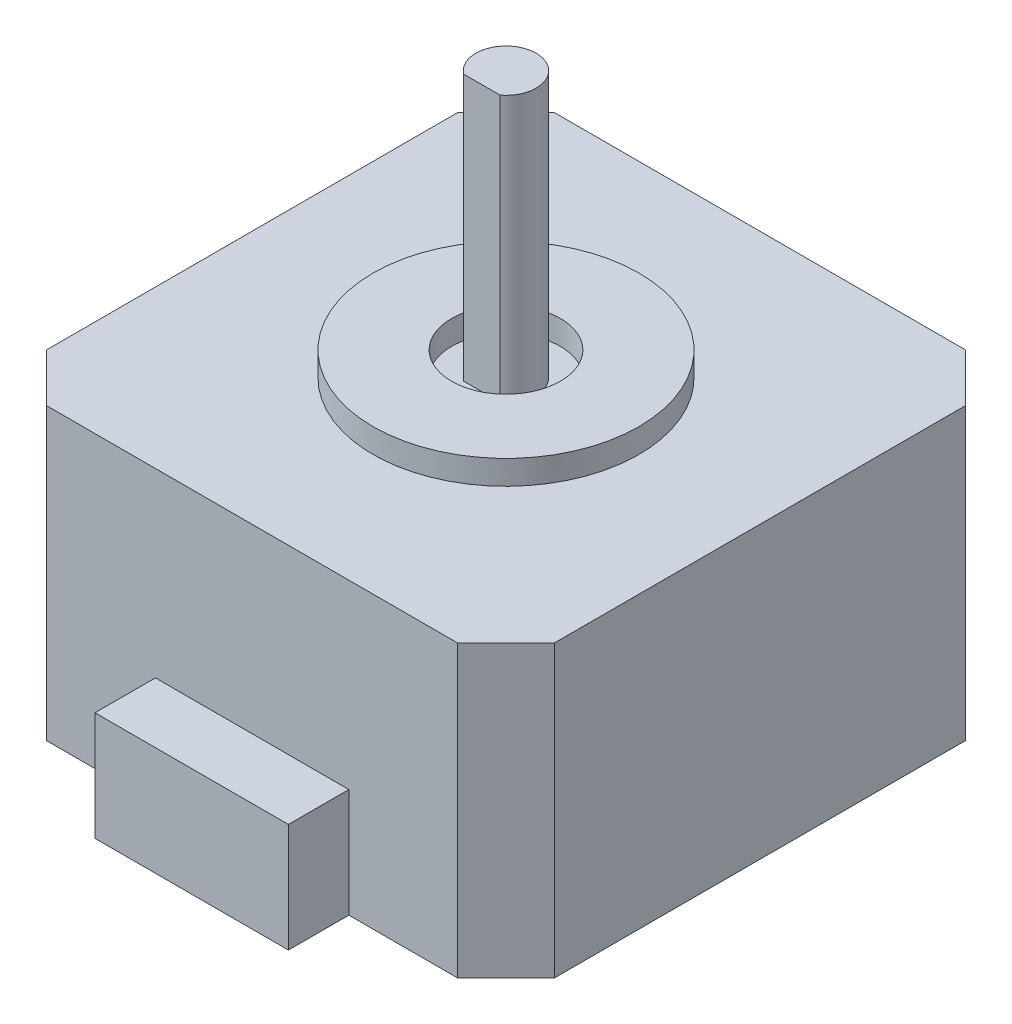
ISO-10303-21;
HEADER;
FILE_DESCRIPTION(('STEP AP214'),'2;1');
FILE_NAME('part.step','',(''),(''),'','','');
FILE_SCHEMA(('AUTOMOTIVE_DESIGN { 1 0 10303 214 1 1 1 1 }'));
ENDSEC;
DATA;
#1=APPLICATION_CONTEXT('core data for automotive mechanical design processes');
#2=APPLICATION_PROTOCOL_DEFINITION('international standard','automotive_design',2000,#1);
#3=PRODUCT_CONTEXT('',#1,'mechanical');
#4=PRODUCT('Part','Part','',(#3));
#5=PRODUCT_RELATED_PRODUCT_CATEGORY('part','',(#4));
#6=PRODUCT_DEFINITION_FORMATION('','',#4);
#7=PRODUCT_DEFINITION_CONTEXT('part definition',#1,'design');
#8=PRODUCT_DEFINITION('design','',#6,#7);
#9=PRODUCT_DEFINITION_SHAPE('','',#8);
#10=(LENGTH_UNIT() NAMED_UNIT(*) SI_UNIT(.MILLI.,.METRE.));
#11=(NAMED_UNIT(*) PLANE_ANGLE_UNIT() SI_UNIT($,.RADIAN.));
#12=(NAMED_UNIT(*) SI_UNIT($,.STERADIAN.) SOLID_ANGLE_UNIT());
#13=UNCERTAINTY_MEASURE_WITH_UNIT(LENGTH_MEASURE(1.E-05),#10,'distance_accuracy_value','');
#14=(GEOMETRIC_REPRESENTATION_CONTEXT(3) GLOBAL_UNCERTAINTY_ASSIGNED_CONTEXT((#13)) GLOBAL_UNIT_ASSIGNED_CONTEXT((#10,
#11,#12)) REPRESENTATION_CONTEXT('',''));
#15=CARTESIAN_POINT('',(0.,0.,0.));
#16=DIRECTION('',(0.,0.,1.));
#17=DIRECTION('',(1.,0.,0.));
#18=AXIS2_PLACEMENT_3D('',#15,#16,#17);
#19=CARTESIAN_POINT('',(0.,24.,0.));
#20=DIRECTION('',(0.,-1.,0.));
#21=DIRECTION('',(0.,0.,-1.));
#22=AXIS2_PLACEMENT_3D('',#19,#20,#21);
#23=PLANE('',#22);
#24=CARTESIAN_POINT('',(21.,24.,-21.));
#25=DIRECTION('',(0.,1.,0.));
#26=DIRECTION('',(0.,0.,1.));
#27=AXIS2_PLACEMENT_3D('',#24,#25,#26);
#28=CIRCLE('',#27,4.5);
#29=CARTESIAN_POINT('',(21.,24.,-16.5));
#30=VERTEX_POINT('',#29);
#31=EDGE_CURVE('E156',#30,#30,#28,.T.);
#32=ORIENTED_EDGE('',*,*,#31,.T.);
#33=EDGE_LOOP('',(#32));
#34=FACE_BOUND('',#33,.T.);
#35=CARTESIAN_POINT('',(21.,24.,-21.));
#36=DIRECTION('',(0.,1.,0.));
#37=DIRECTION('',(0.,0.,1.));
#38=AXIS2_PLACEMENT_3D('',#35,#36,#37);
#39=CIRCLE('',#38,2.5);
#40=CARTESIAN_POINT('',(22.5,24.,-19.));
#41=VERTEX_POINT('',#40);
#42=CARTESIAN_POINT('',(19.5,24.,-19.));
#43=VERTEX_POINT('',#42);
#44=EDGE_CURVE('E155',#41,#43,#39,.T.);
#45=ORIENTED_EDGE('',*,*,#44,.F.);
#46=DIRECTION('',(1.,0.,0.));
#47=VECTOR('',#46,1.);
#48=CARTESIAN_POINT('',(19.5,24.,-19.));
#49=LINE('',#48,#47);
#50=EDGE_CURVE('E152',#43,#41,#49,.T.);
#51=ORIENTED_EDGE('',*,*,#50,.F.);
#52=EDGE_LOOP('',(#45,#51));
#53=FACE_BOUND('',#52,.T.);
#54=ADVANCED_FACE('F35',(#34,#53),#23,.F.);
#55=CARTESIAN_POINT('',(0.,24.,0.));
#56=DIRECTION('',(0.,0.,-1.));
#57=DIRECTION('',(-1.,0.,0.));
#58=AXIS2_PLACEMENT_3D('',#55,#56,#57);
#59=PLANE('',#58);
#60=DIRECTION('',(1.,0.,0.));
#61=VECTOR('',#60,1.);
#62=CARTESIAN_POINT('',(0.,0.,0.));
#63=LINE('',#62,#61);
#64=CARTESIAN_POINT('',(29.,0.,0.));
#65=VERTEX_POINT('',#64);
#66=CARTESIAN_POINT('',(38.,0.,0.));
#67=VERTEX_POINT('',#66);
#68=EDGE_CURVE('E213',#65,#67,#63,.T.);
#69=ORIENTED_EDGE('',*,*,#68,.T.);
#70=DIRECTION('',(0.,1.,0.));
#71=VECTOR('',#70,1.);
#72=CARTESIAN_POINT('',(38.,24.,0.));
#73=LINE('',#72,#71);
#74=CARTESIAN_POINT('',(38.,24.,0.));
#75=VERTEX_POINT('',#74);
#76=EDGE_CURVE('E238',#67,#75,#73,.T.);
#77=ORIENTED_EDGE('',*,*,#76,.T.);
#78=DIRECTION('',(1.,0.,0.));
#79=VECTOR('',#78,1.);
#80=CARTESIAN_POINT('',(0.,24.,0.));
#81=LINE('',#80,#79);
#82=CARTESIAN_POINT('',(4.00000000000001,24.,0.));
#83=VERTEX_POINT('',#82);
#84=EDGE_CURVE('E202',#83,#75,#81,.T.);
#85=ORIENTED_EDGE('',*,*,#84,.F.);
#86=DIRECTION('',(0.,-1.,0.));
#87=VECTOR('',#86,1.);
#88=CARTESIAN_POINT('',(4.00000000000001,24.,0.));
#89=LINE('',#88,#87);
#90=CARTESIAN_POINT('',(4.00000000000001,0.,0.));
#91=VERTEX_POINT('',#90);
#92=EDGE_CURVE('E222',#83,#91,#89,.T.);
#93=ORIENTED_EDGE('',*,*,#92,.T.);
#94=CARTESIAN_POINT('',(13.,0.,0.));
#95=VERTEX_POINT('',#94);
#96=EDGE_CURVE('E214',#91,#95,#63,.T.);
#97=ORIENTED_EDGE('',*,*,#96,.T.);
#98=DIRECTION('',(0.,-1.,0.));
#99=VECTOR('',#98,1.);
#100=CARTESIAN_POINT('',(13.,0.,0.));
#101=LINE('',#100,#99);
#102=CARTESIAN_POINT('',(13.,9.,0.));
#103=VERTEX_POINT('',#102);
#104=EDGE_CURVE('E169',#103,#95,#101,.T.);
#105=ORIENTED_EDGE('',*,*,#104,.F.);
#106=DIRECTION('',(-1.,0.,0.));
#107=VECTOR('',#106,1.);
#108=CARTESIAN_POINT('',(13.,9.,0.));
#109=LINE('',#108,#107);
#110=CARTESIAN_POINT('',(29.,9.,0.));
#111=VERTEX_POINT('',#110);
#112=EDGE_CURVE('E174',#111,#103,#109,.T.);
#113=ORIENTED_EDGE('',*,*,#112,.F.);
#114=DIRECTION('',(0.,1.,0.));
#115=VECTOR('',#114,1.);
#116=CARTESIAN_POINT('',(29.,0.,0.));
#117=LINE('',#116,#115);
#118=EDGE_CURVE('E183',#65,#111,#117,.T.);
#119=ORIENTED_EDGE('',*,*,#118,.F.);
#120=EDGE_LOOP('',(#69,#77,#85,#93,#97,#105,#113,#119));
#121=FACE_BOUND('',#120,.T.);
#122=ADVANCED_FACE('F273',(#121),#59,.F.);
#123=CARTESIAN_POINT('',(0.,24.,0.));
#124=DIRECTION('',(1.,0.,0.));
#125=DIRECTION('',(0.,0.,-1.));
#126=AXIS2_PLACEMENT_3D('',#123,#124,#125);
#127=PLANE('',#126);
#128=DIRECTION('',(0.,0.,1.));
#129=VECTOR('',#128,1.);
#130=CARTESIAN_POINT('',(0.,24.,0.));
#131=LINE('',#130,#129);
#132=CARTESIAN_POINT('',(0.,24.,-38.));
#133=VERTEX_POINT('',#132);
#134=CARTESIAN_POINT('',(0.,24.,-4.00000000000001));
#135=VERTEX_POINT('',#134);
#136=EDGE_CURVE('E200',#133,#135,#131,.T.);
#137=ORIENTED_EDGE('',*,*,#136,.F.);
#138=DIRECTION('',(0.,-1.,0.));
#139=VECTOR('',#138,1.);
#140=CARTESIAN_POINT('',(0.,24.,-38.));
#141=LINE('',#140,#139);
#142=CARTESIAN_POINT('',(0.,0.,-38.));
#143=VERTEX_POINT('',#142);
#144=EDGE_CURVE('E251',#133,#143,#141,.T.);
#145=ORIENTED_EDGE('',*,*,#144,.T.);
#146=DIRECTION('',(0.,0.,1.));
#147=VECTOR('',#146,1.);
#148=CARTESIAN_POINT('',(0.,0.,0.));
#149=LINE('',#148,#147);
#150=CARTESIAN_POINT('',(0.,0.,-4.00000000000001));
#151=VERTEX_POINT('',#150);
#152=EDGE_CURVE('E199',#143,#151,#149,.T.);
#153=ORIENTED_EDGE('',*,*,#152,.T.);
#154=DIRECTION('',(0.,1.,0.));
#155=VECTOR('',#154,1.);
#156=CARTESIAN_POINT('',(0.,24.,-4.00000000000001));
#157=LINE('',#156,#155);
#158=EDGE_CURVE('E228',#151,#135,#157,.T.);
#159=ORIENTED_EDGE('',*,*,#158,.T.);
#160=EDGE_LOOP('',(#137,#145,#153,#159));
#161=FACE_BOUND('',#160,.T.);
#162=ADVANCED_FACE('F257',(#161),#127,.F.);
#163=CARTESIAN_POINT('',(42.,24.,0.));
#164=DIRECTION('',(-1.,0.,0.));
#165=DIRECTION('',(0.,0.,1.));
#166=AXIS2_PLACEMENT_3D('',#163,#164,#165);
#167=PLANE('',#166);
#168=DIRECTION('',(0.,0.,-1.));
#169=VECTOR('',#168,1.);
#170=CARTESIAN_POINT('',(42.,0.,0.));
#171=LINE('',#170,#169);
#172=CARTESIAN_POINT('',(42.,0.,-4.00000000000002));
#173=VERTEX_POINT('',#172);
#174=CARTESIAN_POINT('',(42.,0.,-38.));
#175=VERTEX_POINT('',#174);
#176=EDGE_CURVE('E216',#173,#175,#171,.T.);
#177=ORIENTED_EDGE('',*,*,#176,.T.);
#178=DIRECTION('',(0.,1.,0.));
#179=VECTOR('',#178,1.);
#180=CARTESIAN_POINT('',(42.,24.,-38.));
#181=LINE('',#180,#179);
#182=CARTESIAN_POINT('',(42.,24.,-38.));
#183=VERTEX_POINT('',#182);
#184=EDGE_CURVE('E247',#175,#183,#181,.T.);
#185=ORIENTED_EDGE('',*,*,#184,.T.);
#186=DIRECTION('',(0.,0.,-1.));
#187=VECTOR('',#186,1.);
#188=CARTESIAN_POINT('',(42.,24.,0.));
#189=LINE('',#188,#187);
#190=CARTESIAN_POINT('',(42.,24.,-4.00000000000002));
#191=VERTEX_POINT('',#190);
#192=EDGE_CURVE('E206',#191,#183,#189,.T.);
#193=ORIENTED_EDGE('',*,*,#192,.F.);
#194=DIRECTION('',(0.,-1.,0.));
#195=VECTOR('',#194,1.);
#196=CARTESIAN_POINT('',(42.,24.,-4.00000000000002));
#197=LINE('',#196,#195);
#198=EDGE_CURVE('E233',#191,#173,#197,.T.);
#199=ORIENTED_EDGE('',*,*,#198,.T.);
#200=EDGE_LOOP('',(#177,#185,#193,#199));
#201=FACE_BOUND('',#200,.T.);
#202=ADVANCED_FACE('F282',(#201),#167,.F.);
#203=CARTESIAN_POINT('',(0.,24.,-42.));
#204=DIRECTION('',(0.,0.,1.));
#205=DIRECTION('',(1.,0.,0.));
#206=AXIS2_PLACEMENT_3D('',#203,#204,#205);
#207=PLANE('',#206);
#208=DIRECTION('',(-1.,0.,0.));
#209=VECTOR('',#208,1.);
#210=CARTESIAN_POINT('',(0.,0.,-42.));
#211=LINE('',#210,#209);
#212=CARTESIAN_POINT('',(38.,0.,-42.));
#213=VERTEX_POINT('',#212);
#214=CARTESIAN_POINT('',(4.00000000000001,0.,-42.));
#215=VERTEX_POINT('',#214);
#216=EDGE_CURVE('E203',#213,#215,#211,.T.);
#217=ORIENTED_EDGE('',*,*,#216,.T.);
#218=DIRECTION('',(0.,1.,0.));
#219=VECTOR('',#218,1.);
#220=CARTESIAN_POINT('',(4.00000000000001,24.,-42.));
#221=LINE('',#220,#219);
#222=CARTESIAN_POINT('',(4.00000000000001,24.,-42.));
#223=VERTEX_POINT('',#222);
#224=EDGE_CURVE('E44',#215,#223,#221,.T.);
#225=ORIENTED_EDGE('',*,*,#224,.T.);
#226=DIRECTION('',(-1.,0.,0.));
#227=VECTOR('',#226,1.);
#228=CARTESIAN_POINT('',(0.,24.,-42.));
#229=LINE('',#228,#227);
#230=CARTESIAN_POINT('',(38.,24.,-42.));
#231=VERTEX_POINT('',#230);
#232=EDGE_CURVE('E209',#231,#223,#229,.T.);
#233=ORIENTED_EDGE('',*,*,#232,.F.);
#234=DIRECTION('',(0.,-1.,0.));
#235=VECTOR('',#234,1.);
#236=CARTESIAN_POINT('',(38.,24.,-42.));
#237=LINE('',#236,#235);
#238=EDGE_CURVE('E242',#231,#213,#237,.T.);
#239=ORIENTED_EDGE('',*,*,#238,.T.);
#240=EDGE_LOOP('',(#217,#225,#233,#239));
#241=FACE_BOUND('',#240,.T.);
#242=ADVANCED_FACE('F288',(#241),#207,.F.);
#243=CARTESIAN_POINT('',(21.,24.,-21.));
#244=DIRECTION('',(0.,-1.,0.));
#245=DIRECTION('',(0.,0.,-1.));
#246=AXIS2_PLACEMENT_3D('',#243,#244,#245);
#247=CIRCLE('',#246,11.);
#248=CARTESIAN_POINT('',(21.,24.,-32.));
#249=VERTEX_POINT('',#248);
#250=EDGE_CURVE('E211',#249,#249,#247,.F.);
#251=ORIENTED_EDGE('',*,*,#250,.F.);
#252=EDGE_LOOP('',(#251));
#253=FACE_BOUND('',#252,.T.);
#254=ORIENTED_EDGE('',*,*,#232,.T.);
#255=DIRECTION('',(0.707106781186548,0.,-0.707106781186547));
#256=VECTOR('',#255,1.);
#257=CARTESIAN_POINT('',(0.,24.,-38.));
#258=LINE('',#257,#256);
#259=EDGE_CURVE('E11',#223,#133,#258,.F.);
#260=ORIENTED_EDGE('',*,*,#259,.T.);
#261=ORIENTED_EDGE('',*,*,#136,.T.);
#262=DIRECTION('',(-0.707106781186548,0.,-0.707106781186548));
#263=VECTOR('',#262,1.);
#264=CARTESIAN_POINT('',(4.00000000000001,24.,0.));
#265=LINE('',#264,#263);
#266=EDGE_CURVE('E231',#135,#83,#265,.F.);
#267=ORIENTED_EDGE('',*,*,#266,.T.);
#268=ORIENTED_EDGE('',*,*,#84,.T.);
#269=DIRECTION('',(-0.707106781186548,0.,0.707106781186548));
#270=VECTOR('',#269,1.);
#271=CARTESIAN_POINT('',(42.,24.,-4.00000000000002));
#272=LINE('',#271,#270);
#273=EDGE_CURVE('E240',#75,#191,#272,.F.);
#274=ORIENTED_EDGE('',*,*,#273,.T.);
#275=ORIENTED_EDGE('',*,*,#192,.T.);
#276=DIRECTION('',(0.707106781186548,0.,0.707106781186548));
#277=VECTOR('',#276,1.);
#278=CARTESIAN_POINT('',(38.,24.,-42.));
#279=LINE('',#278,#277);
#280=EDGE_CURVE('E249',#183,#231,#279,.F.);
#281=ORIENTED_EDGE('',*,*,#280,.T.);
#282=EDGE_LOOP('',(#254,#260,#261,#267,#268,#274,#275,#281));
#283=FACE_BOUND('',#282,.T.);
#284=ADVANCED_FACE('F269',(#253,#283),#23,.F.);
#285=CARTESIAN_POINT('',(0.,0.,0.));
#286=DIRECTION('',(0.,-1.,0.));
#287=DIRECTION('',(0.,0.,-1.));
#288=AXIS2_PLACEMENT_3D('',#285,#286,#287);
#289=PLANE('',#288);
#290=ORIENTED_EDGE('',*,*,#152,.F.);
#291=DIRECTION('',(-0.707106781186548,0.,0.707106781186547));
#292=VECTOR('',#291,1.);
#293=CARTESIAN_POINT('',(-19.,0.,-19.));
#294=LINE('',#293,#292);
#295=EDGE_CURVE('E58',#143,#215,#294,.F.);
#296=ORIENTED_EDGE('',*,*,#295,.T.);
#297=ORIENTED_EDGE('',*,*,#216,.F.);
#298=DIRECTION('',(-0.707106781186548,0.,-0.707106781186548));
#299=VECTOR('',#298,1.);
#300=CARTESIAN_POINT('',(40.,0.,-40.));
#301=LINE('',#300,#299);
#302=EDGE_CURVE('E245',#213,#175,#301,.F.);
#303=ORIENTED_EDGE('',*,*,#302,.T.);
#304=ORIENTED_EDGE('',*,*,#176,.F.);
#305=DIRECTION('',(0.707106781186548,0.,-0.707106781186548));
#306=VECTOR('',#305,1.);
#307=CARTESIAN_POINT('',(19.,0.,19.));
#308=LINE('',#307,#306);
#309=EDGE_CURVE('E236',#173,#67,#308,.F.);
#310=ORIENTED_EDGE('',*,*,#309,.T.);
#311=ORIENTED_EDGE('',*,*,#68,.F.);
#312=DIRECTION('',(0.,0.,-1.));
#313=VECTOR('',#312,1.);
#314=CARTESIAN_POINT('',(29.,0.,5.));
#315=LINE('',#314,#313);
#316=CARTESIAN_POINT('',(29.,0.,5.));
#317=VERTEX_POINT('',#316);
#318=EDGE_CURVE('E193',#317,#65,#315,.T.);
#319=ORIENTED_EDGE('',*,*,#318,.F.);
#320=DIRECTION('',(1.,0.,0.));
#321=VECTOR('',#320,1.);
#322=CARTESIAN_POINT('',(13.,0.,5.));
#323=LINE('',#322,#321);
#324=CARTESIAN_POINT('',(13.,0.,5.));
#325=VERTEX_POINT('',#324);
#326=EDGE_CURVE('E173',#325,#317,#323,.T.);
#327=ORIENTED_EDGE('',*,*,#326,.F.);
#328=DIRECTION('',(0.,0.,-1.));
#329=VECTOR('',#328,1.);
#330=CARTESIAN_POINT('',(13.,0.,5.));
#331=LINE('',#330,#329);
#332=EDGE_CURVE('E196',#325,#95,#331,.T.);
#333=ORIENTED_EDGE('',*,*,#332,.T.);
#334=ORIENTED_EDGE('',*,*,#96,.F.);
#335=DIRECTION('',(0.707106781186548,0.,0.707106781186548));
#336=VECTOR('',#335,1.);
#337=CARTESIAN_POINT('',(2.00000000000001,0.,-2.00000000000001));
#338=LINE('',#337,#336);
#339=EDGE_CURVE('E225',#91,#151,#338,.F.);
#340=ORIENTED_EDGE('',*,*,#339,.T.);
#341=EDGE_LOOP('',(#290,#296,#297,#303,#304,#310,#311,#319,#327,#333,#334,#340));
#342=FACE_BOUND('',#341,.T.);
#343=ADVANCED_FACE('F260',(#342),#289,.T.);
#344=CARTESIAN_POINT('',(13.,0.,5.));
#345=DIRECTION('',(1.,0.,0.));
#346=DIRECTION('',(0.,0.,-1.));
#347=AXIS2_PLACEMENT_3D('',#344,#345,#346);
#348=PLANE('',#347);
#349=ORIENTED_EDGE('',*,*,#104,.T.);
#350=ORIENTED_EDGE('',*,*,#332,.F.);
#351=DIRECTION('',(0.,-1.,0.));
#352=VECTOR('',#351,1.);
#353=CARTESIAN_POINT('',(13.,0.,5.));
#354=LINE('',#353,#352);
#355=CARTESIAN_POINT('',(13.,9.,5.));
#356=VERTEX_POINT('',#355);
#357=EDGE_CURVE('E170',#356,#325,#354,.T.);
#358=ORIENTED_EDGE('',*,*,#357,.F.);
#359=DIRECTION('',(0.,0.,-1.));
#360=VECTOR('',#359,1.);
#361=CARTESIAN_POINT('',(13.,9.,5.));
#362=LINE('',#361,#360);
#363=EDGE_CURVE('E180',#356,#103,#362,.T.);
#364=ORIENTED_EDGE('',*,*,#363,.T.);
#365=EDGE_LOOP('',(#349,#350,#358,#364));
#366=FACE_BOUND('',#365,.T.);
#367=ADVANCED_FACE('F301',(#366),#348,.F.);
#368=CARTESIAN_POINT('',(29.,0.,5.));
#369=DIRECTION('',(-1.,0.,0.));
#370=DIRECTION('',(0.,0.,1.));
#371=AXIS2_PLACEMENT_3D('',#368,#369,#370);
#372=PLANE('',#371);
#373=ORIENTED_EDGE('',*,*,#118,.T.);
#374=DIRECTION('',(0.,0.,-1.));
#375=VECTOR('',#374,1.);
#376=CARTESIAN_POINT('',(29.,9.,5.));
#377=LINE('',#376,#375);
#378=CARTESIAN_POINT('',(29.,9.,5.));
#379=VERTEX_POINT('',#378);
#380=EDGE_CURVE('E190',#379,#111,#377,.T.);
#381=ORIENTED_EDGE('',*,*,#380,.F.);
#382=DIRECTION('',(0.,1.,0.));
#383=VECTOR('',#382,1.);
#384=CARTESIAN_POINT('',(29.,0.,5.));
#385=LINE('',#384,#383);
#386=EDGE_CURVE('E176',#317,#379,#385,.T.);
#387=ORIENTED_EDGE('',*,*,#386,.F.);
#388=ORIENTED_EDGE('',*,*,#318,.T.);
#389=EDGE_LOOP('',(#373,#381,#387,#388));
#390=FACE_BOUND('',#389,.T.);
#391=ADVANCED_FACE('F292',(#390),#372,.F.);
#392=CARTESIAN_POINT('',(13.,9.,5.));
#393=DIRECTION('',(0.,-1.,0.));
#394=DIRECTION('',(0.,0.,-1.));
#395=AXIS2_PLACEMENT_3D('',#392,#393,#394);
#396=PLANE('',#395);
#397=ORIENTED_EDGE('',*,*,#112,.T.);
#398=ORIENTED_EDGE('',*,*,#363,.F.);
#399=DIRECTION('',(-1.,0.,0.));
#400=VECTOR('',#399,1.);
#401=CARTESIAN_POINT('',(13.,9.,5.));
#402=LINE('',#401,#400);
#403=EDGE_CURVE('E178',#379,#356,#402,.T.);
#404=ORIENTED_EDGE('',*,*,#403,.F.);
#405=ORIENTED_EDGE('',*,*,#380,.T.);
#406=EDGE_LOOP('',(#397,#398,#404,#405));
#407=FACE_BOUND('',#406,.T.);
#408=ADVANCED_FACE('F303',(#407),#396,.F.);
#409=CARTESIAN_POINT('',(0.,0.,5.));
#410=DIRECTION('',(0.,0.,-1.));
#411=DIRECTION('',(-1.,0.,0.));
#412=AXIS2_PLACEMENT_3D('',#409,#410,#411);
#413=PLANE('',#412);
#414=ORIENTED_EDGE('',*,*,#357,.T.);
#415=ORIENTED_EDGE('',*,*,#326,.T.);
#416=ORIENTED_EDGE('',*,*,#386,.T.);
#417=ORIENTED_EDGE('',*,*,#403,.T.);
#418=EDGE_LOOP('',(#414,#415,#416,#417));
#419=FACE_BOUND('',#418,.T.);
#420=ADVANCED_FACE('F296',(#419),#413,.F.);
#421=CARTESIAN_POINT('',(21.,26.,-21.));
#422=DIRECTION('',(0.,1.,0.));
#423=DIRECTION('',(0.,0.,1.));
#424=AXIS2_PLACEMENT_3D('',#421,#422,#423);
#425=PLANE('',#424);
#426=CARTESIAN_POINT('',(21.,26.,-21.));
#427=DIRECTION('',(0.,1.,0.));
#428=DIRECTION('',(0.,0.,1.));
#429=AXIS2_PLACEMENT_3D('',#426,#427,#428);
#430=CIRCLE('',#429,11.);
#431=CARTESIAN_POINT('',(21.,26.,-10.));
#432=VERTEX_POINT('',#431);
#433=EDGE_CURVE('E165',#432,#432,#430,.T.);
#434=ORIENTED_EDGE('',*,*,#433,.T.);
#435=EDGE_LOOP('',(#434));
#436=FACE_BOUND('',#435,.T.);
#437=CARTESIAN_POINT('',(21.,26.,-21.));
#438=DIRECTION('',(0.,1.,0.));
#439=DIRECTION('',(0.,0.,1.));
#440=AXIS2_PLACEMENT_3D('',#437,#438,#439);
#441=CIRCLE('',#440,4.5);
#442=CARTESIAN_POINT('',(21.,26.,-16.5));
#443=VERTEX_POINT('',#442);
#444=EDGE_CURVE('E159',#443,#443,#441,.T.);
#445=ORIENTED_EDGE('',*,*,#444,.F.);
#446=EDGE_LOOP('',(#445));
#447=FACE_BOUND('',#446,.T.);
#448=ADVANCED_FACE('F310',(#436,#447),#425,.T.);
#449=CARTESIAN_POINT('',(21.,26.,-21.));
#450=DIRECTION('',(0.,-1.,0.));
#451=DIRECTION('',(0.,0.,-1.));
#452=AXIS2_PLACEMENT_3D('',#449,#450,#451);
#453=CYLINDRICAL_SURFACE('',#452,11.);
#454=ORIENTED_EDGE('',*,*,#433,.F.);
#455=EDGE_LOOP('',(#454));
#456=FACE_BOUND('',#455,.T.);
#457=ORIENTED_EDGE('',*,*,#250,.T.);
#458=EDGE_LOOP('',(#457));
#459=FACE_BOUND('',#458,.T.);
#460=ADVANCED_FACE('F332',(#456,#459),#453,.T.);
#461=CARTESIAN_POINT('',(21.,26.,-21.));
#462=DIRECTION('',(0.,-1.,0.));
#463=DIRECTION('',(0.,0.,-1.));
#464=AXIS2_PLACEMENT_3D('',#461,#462,#463);
#465=CYLINDRICAL_SURFACE('',#464,4.5);
#466=ORIENTED_EDGE('',*,*,#444,.T.);
#467=EDGE_LOOP('',(#466));
#468=FACE_BOUND('',#467,.T.);
#469=ORIENTED_EDGE('',*,*,#31,.F.);
#470=EDGE_LOOP('',(#469));
#471=FACE_BOUND('',#470,.T.);
#472=ADVANCED_FACE('F334',(#468,#471),#465,.F.);
#473=CARTESIAN_POINT('',(21.,46.,-21.));
#474=DIRECTION('',(0.,-1.,0.));
#475=DIRECTION('',(0.,0.,-1.));
#476=AXIS2_PLACEMENT_3D('',#473,#474,#475);
#477=CYLINDRICAL_SURFACE('',#476,2.5);
#478=ORIENTED_EDGE('',*,*,#44,.T.);
#479=DIRECTION('',(0.,-1.,0.));
#480=VECTOR('',#479,1.);
#481=CARTESIAN_POINT('',(19.5,46.,-19.));
#482=LINE('',#481,#480);
#483=CARTESIAN_POINT('',(19.5,46.,-19.));
#484=VERTEX_POINT('',#483);
#485=EDGE_CURVE('E142',#484,#43,#482,.T.);
#486=ORIENTED_EDGE('',*,*,#485,.F.);
#487=CARTESIAN_POINT('',(21.,46.,-21.));
#488=DIRECTION('',(0.,1.,0.));
#489=DIRECTION('',(0.,0.,1.));
#490=AXIS2_PLACEMENT_3D('',#487,#488,#489);
#491=CIRCLE('',#490,2.5);
#492=CARTESIAN_POINT('',(22.5,46.,-19.));
#493=VERTEX_POINT('',#492);
#494=EDGE_CURVE('E148',#493,#484,#491,.T.);
#495=ORIENTED_EDGE('',*,*,#494,.F.);
#496=DIRECTION('',(0.,-1.,0.));
#497=VECTOR('',#496,1.);
#498=CARTESIAN_POINT('',(22.5,46.,-19.));
#499=LINE('',#498,#497);
#500=EDGE_CURVE('E145',#493,#41,#499,.T.);
#501=ORIENTED_EDGE('',*,*,#500,.T.);
#502=EDGE_LOOP('',(#478,#486,#495,#501));
#503=FACE_BOUND('',#502,.T.);
#504=ADVANCED_FACE('F154',(#503),#477,.T.);
#505=CARTESIAN_POINT('',(19.5,46.,-19.));
#506=DIRECTION('',(0.,0.,-1.));
#507=DIRECTION('',(-1.,0.,0.));
#508=AXIS2_PLACEMENT_3D('',#505,#506,#507);
#509=PLANE('',#508);
#510=ORIENTED_EDGE('',*,*,#50,.T.);
#511=ORIENTED_EDGE('',*,*,#500,.F.);
#512=DIRECTION('',(1.,0.,0.));
#513=VECTOR('',#512,1.);
#514=CARTESIAN_POINT('',(19.5,46.,-19.));
#515=LINE('',#514,#513);
#516=EDGE_CURVE('E137',#484,#493,#515,.T.);
#517=ORIENTED_EDGE('',*,*,#516,.F.);
#518=ORIENTED_EDGE('',*,*,#485,.T.);
#519=EDGE_LOOP('',(#510,#511,#517,#518));
#520=FACE_BOUND('',#519,.T.);
#521=ADVANCED_FACE('F140',(#520),#509,.F.);
#522=CARTESIAN_POINT('',(21.,46.,-21.));
#523=DIRECTION('',(0.,1.,0.));
#524=DIRECTION('',(0.,0.,1.));
#525=AXIS2_PLACEMENT_3D('',#522,#523,#524);
#526=PLANE('',#525);
#527=ORIENTED_EDGE('',*,*,#494,.T.);
#528=ORIENTED_EDGE('',*,*,#516,.T.);
#529=EDGE_LOOP('',(#527,#528));
#530=FACE_BOUND('',#529,.T.);
#531=ADVANCED_FACE('F150',(#530),#526,.T.);
#532=CARTESIAN_POINT('',(4.00000000000001,24.,0.));
#533=DIRECTION('',(0.707106781186548,0.,-0.707106781186548));
#534=DIRECTION('',(0.,-1.,0.));
#535=AXIS2_PLACEMENT_3D('',#532,#533,#534);
#536=PLANE('',#535);
#537=ORIENTED_EDGE('',*,*,#266,.F.);
#538=ORIENTED_EDGE('',*,*,#158,.F.);
#539=ORIENTED_EDGE('',*,*,#339,.F.);
#540=ORIENTED_EDGE('',*,*,#92,.F.);
#541=EDGE_LOOP('',(#537,#538,#539,#540));
#542=FACE_BOUND('',#541,.T.);
#543=ADVANCED_FACE('F266',(#542),#536,.F.);
#544=CARTESIAN_POINT('',(42.,24.,-4.00000000000002));
#545=DIRECTION('',(-0.707106781186548,0.,-0.707106781186548));
#546=DIRECTION('',(0.,-1.,0.));
#547=AXIS2_PLACEMENT_3D('',#544,#545,#546);
#548=PLANE('',#547);
#549=ORIENTED_EDGE('',*,*,#273,.F.);
#550=ORIENTED_EDGE('',*,*,#76,.F.);
#551=ORIENTED_EDGE('',*,*,#309,.F.);
#552=ORIENTED_EDGE('',*,*,#198,.F.);
#553=EDGE_LOOP('',(#549,#550,#551,#552));
#554=FACE_BOUND('',#553,.T.);
#555=ADVANCED_FACE('F277',(#554),#548,.F.);
#556=CARTESIAN_POINT('',(38.,24.,-42.));
#557=DIRECTION('',(-0.707106781186548,0.,0.707106781186548));
#558=DIRECTION('',(0.,-1.,0.));
#559=AXIS2_PLACEMENT_3D('',#556,#557,#558);
#560=PLANE('',#559);
#561=ORIENTED_EDGE('',*,*,#280,.F.);
#562=ORIENTED_EDGE('',*,*,#184,.F.);
#563=ORIENTED_EDGE('',*,*,#302,.F.);
#564=ORIENTED_EDGE('',*,*,#238,.F.);
#565=EDGE_LOOP('',(#561,#562,#563,#564));
#566=FACE_BOUND('',#565,.T.);
#567=ADVANCED_FACE('F286',(#566),#560,.F.);
#568=CARTESIAN_POINT('',(0.,24.,-38.));
#569=DIRECTION('',(0.707106781186547,0.,0.707106781186548));
#570=DIRECTION('',(0.,-1.,0.));
#571=AXIS2_PLACEMENT_3D('',#568,#569,#570);
#572=PLANE('',#571);
#573=ORIENTED_EDGE('',*,*,#259,.F.);
#574=ORIENTED_EDGE('',*,*,#224,.F.);
#575=ORIENTED_EDGE('',*,*,#295,.F.);
#576=ORIENTED_EDGE('',*,*,#144,.F.);
#577=EDGE_LOOP('',(#573,#574,#575,#576));
#578=FACE_BOUND('',#577,.T.);
#579=ADVANCED_FACE('F38',(#578),#572,.F.);
#580=CLOSED_SHELL('',(#54,#122,#162,#202,#242,#284,#343,#367,#391,#408,#420,#448,#460,#472,#504,
#521,#531,#543,#555,#567,#579));
#581=MANIFOLD_SOLID_BREP('B2',#580);
#582=ADVANCED_BREP_SHAPE_REPRESENTATION('',(#18,#581),#14);
#583=SHAPE_DEFINITION_REPRESENTATION(#9,#582);
ENDSEC;
END-ISO-10303-21;
